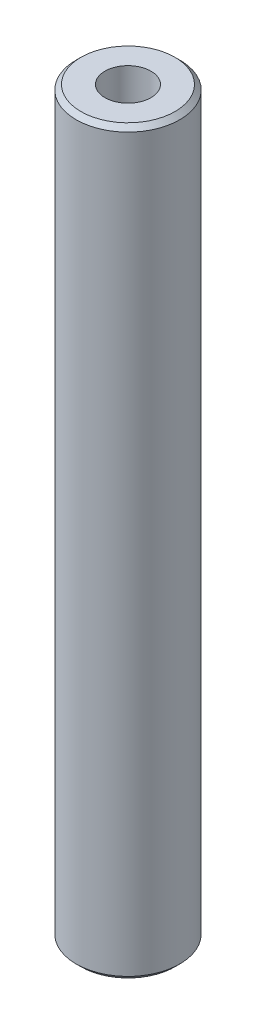
ISO-10303-21;
HEADER;
FILE_DESCRIPTION(('STEP AP214'),'2;1');
FILE_NAME('part.step','',(''),(''),'','','');
FILE_SCHEMA(('AUTOMOTIVE_DESIGN { 1 0 10303 214 1 1 1 1 }'));
ENDSEC;
DATA;
#1=APPLICATION_CONTEXT('core data for automotive mechanical design processes');
#2=APPLICATION_PROTOCOL_DEFINITION('international standard','automotive_design',2000,#1);
#3=PRODUCT_CONTEXT('',#1,'mechanical');
#4=PRODUCT('Part','Part','',(#3));
#5=PRODUCT_RELATED_PRODUCT_CATEGORY('part','',(#4));
#6=PRODUCT_DEFINITION_FORMATION('','',#4);
#7=PRODUCT_DEFINITION_CONTEXT('part definition',#1,'design');
#8=PRODUCT_DEFINITION('design','',#6,#7);
#9=PRODUCT_DEFINITION_SHAPE('','',#8);
#10=(LENGTH_UNIT() NAMED_UNIT(*) SI_UNIT(.MILLI.,.METRE.));
#11=(NAMED_UNIT(*) PLANE_ANGLE_UNIT() SI_UNIT($,.RADIAN.));
#12=(NAMED_UNIT(*) SI_UNIT($,.STERADIAN.) SOLID_ANGLE_UNIT());
#13=UNCERTAINTY_MEASURE_WITH_UNIT(LENGTH_MEASURE(1.E-05),#10,'distance_accuracy_value','');
#14=(GEOMETRIC_REPRESENTATION_CONTEXT(3) GLOBAL_UNCERTAINTY_ASSIGNED_CONTEXT((#13)) GLOBAL_UNIT_ASSIGNED_CONTEXT((#10,
#11,#12)) REPRESENTATION_CONTEXT('',''));
#15=CARTESIAN_POINT('',(0.,0.,0.));
#16=DIRECTION('',(0.,0.,1.));
#17=DIRECTION('',(1.,0.,0.));
#18=AXIS2_PLACEMENT_3D('',#15,#16,#17);
#19=CARTESIAN_POINT('',(0.,107.264778660228,0.));
#20=DIRECTION('',(0.,-1.,0.));
#21=DIRECTION('',(0.,0.,-1.));
#22=AXIS2_PLACEMENT_3D('',#19,#20,#21);
#23=CYLINDRICAL_SURFACE('',#22,7.5);
#24=CARTESIAN_POINT('',(0.,106.577914676238,0.));
#25=DIRECTION('',(0.,1.,0.));
#26=DIRECTION('',(0.,0.,1.));
#27=AXIS2_PLACEMENT_3D('',#24,#25,#26);
#28=CIRCLE('',#27,7.5);
#29=CARTESIAN_POINT('',(0.,106.577914676238,7.5));
#30=VERTEX_POINT('',#29);
#31=EDGE_CURVE('E50',#30,#30,#28,.F.);
#32=ORIENTED_EDGE('',*,*,#31,.T.);
#33=EDGE_LOOP('',(#32));
#34=FACE_BOUND('',#33,.T.);
#35=CARTESIAN_POINT('',(0.,0.6868639839894,0.));
#36=DIRECTION('',(0.,1.,0.));
#37=DIRECTION('',(0.,0.,1.));
#38=AXIS2_PLACEMENT_3D('',#35,#36,#37);
#39=CIRCLE('',#38,7.5);
#40=CARTESIAN_POINT('',(0.,0.6868639839894,7.5));
#41=VERTEX_POINT('',#40);
#42=EDGE_CURVE('E51',#41,#41,#39,.T.);
#43=ORIENTED_EDGE('',*,*,#42,.T.);
#44=EDGE_LOOP('',(#43));
#45=FACE_BOUND('',#44,.T.);
#46=ADVANCED_FACE('F39',(#34,#45),#23,.T.);
#47=CARTESIAN_POINT('',(0.,107.264778660228,0.));
#48=DIRECTION('',(0.,1.,0.));
#49=DIRECTION('',(0.,0.,1.));
#50=AXIS2_PLACEMENT_3D('',#47,#48,#49);
#51=PLANE('',#50);
#52=CARTESIAN_POINT('',(0.,107.264778660228,0.));
#53=DIRECTION('',(0.,1.,0.));
#54=DIRECTION('',(0.,0.,1.));
#55=AXIS2_PLACEMENT_3D('',#52,#53,#54);
#56=CIRCLE('',#55,6.81313601601058);
#57=CARTESIAN_POINT('',(0.,107.264778660228,6.81313601601058));
#58=VERTEX_POINT('',#57);
#59=EDGE_CURVE('E54',#58,#58,#56,.T.);
#60=ORIENTED_EDGE('',*,*,#59,.T.);
#61=EDGE_LOOP('',(#60));
#62=FACE_BOUND('',#61,.T.);
#63=CARTESIAN_POINT('',(0.,107.264778660228,0.));
#64=DIRECTION('',(0.,1.,0.));
#65=DIRECTION('',(0.,0.,1.));
#66=AXIS2_PLACEMENT_3D('',#63,#64,#65);
#67=CIRCLE('',#66,3.3325501859884);
#68=CARTESIAN_POINT('',(0.,107.264778660228,3.3325501859884));
#69=VERTEX_POINT('',#68);
#70=EDGE_CURVE('E58',#69,#69,#67,.T.);
#71=ORIENTED_EDGE('',*,*,#70,.F.);
#72=EDGE_LOOP('',(#71));
#73=FACE_BOUND('',#72,.T.);
#74=ADVANCED_FACE('F69',(#62,#73),#51,.T.);
#75=CARTESIAN_POINT('',(0.,0.,0.));
#76=DIRECTION('',(0.,1.,0.));
#77=DIRECTION('',(0.,0.,1.));
#78=AXIS2_PLACEMENT_3D('',#75,#76,#77);
#79=PLANE('',#78);
#80=CARTESIAN_POINT('',(0.,0.,0.));
#81=DIRECTION('',(0.,1.,0.));
#82=DIRECTION('',(0.,0.,1.));
#83=AXIS2_PLACEMENT_3D('',#80,#81,#82);
#84=CIRCLE('',#83,6.81313601601059);
#85=CARTESIAN_POINT('',(0.,0.,6.81313601601059));
#86=VERTEX_POINT('',#85);
#87=EDGE_CURVE('E10',#86,#86,#84,.F.);
#88=ORIENTED_EDGE('',*,*,#87,.T.);
#89=EDGE_LOOP('',(#88));
#90=FACE_BOUND('',#89,.T.);
#91=CARTESIAN_POINT('',(0.,0.,0.));
#92=DIRECTION('',(0.,1.,0.));
#93=DIRECTION('',(0.,0.,1.));
#94=AXIS2_PLACEMENT_3D('',#91,#92,#93);
#95=CIRCLE('',#94,3.3325501859884);
#96=CARTESIAN_POINT('',(0.,0.,3.3325501859884));
#97=VERTEX_POINT('',#96);
#98=EDGE_CURVE('E63',#97,#97,#95,.T.);
#99=ORIENTED_EDGE('',*,*,#98,.T.);
#100=EDGE_LOOP('',(#99));
#101=FACE_BOUND('',#100,.T.);
#102=ADVANCED_FACE('F75',(#90,#101),#79,.F.);
#103=CARTESIAN_POINT('',(0.,107.264778660228,0.));
#104=DIRECTION('',(0.,-1.,0.));
#105=DIRECTION('',(0.,0.,-1.));
#106=AXIS2_PLACEMENT_3D('',#103,#104,#105);
#107=CYLINDRICAL_SURFACE('',#106,3.3325501859884);
#108=ORIENTED_EDGE('',*,*,#70,.T.);
#109=EDGE_LOOP('',(#108));
#110=FACE_BOUND('',#109,.T.);
#111=ORIENTED_EDGE('',*,*,#98,.F.);
#112=EDGE_LOOP('',(#111));
#113=FACE_BOUND('',#112,.T.);
#114=ADVANCED_FACE('F70',(#110,#113),#107,.F.);
#115=CARTESIAN_POINT('',(0.,107.264778660228,0.));
#116=DIRECTION('',(0.,-1.,0.));
#117=DIRECTION('',(0.,0.,-1.));
#118=AXIS2_PLACEMENT_3D('',#115,#116,#117);
#119=CONICAL_SURFACE('',#118,6.81313601601058,0.785398163397443);
#120=ORIENTED_EDGE('',*,*,#31,.F.);
#121=EDGE_LOOP('',(#120));
#122=FACE_BOUND('',#121,.T.);
#123=ORIENTED_EDGE('',*,*,#59,.F.);
#124=EDGE_LOOP('',(#123));
#125=FACE_BOUND('',#124,.T.);
#126=ADVANCED_FACE('F81',(#122,#125),#119,.T.);
#127=CARTESIAN_POINT('',(0.,0.6868639839894,0.));
#128=DIRECTION('',(0.,1.,0.));
#129=DIRECTION('',(0.,0.,1.));
#130=AXIS2_PLACEMENT_3D('',#127,#128,#129);
#131=CONICAL_SURFACE('',#130,7.5,0.785398163397453);
#132=ORIENTED_EDGE('',*,*,#87,.F.);
#133=EDGE_LOOP('',(#132));
#134=FACE_BOUND('',#133,.T.);
#135=ORIENTED_EDGE('',*,*,#42,.F.);
#136=EDGE_LOOP('',(#135));
#137=FACE_BOUND('',#136,.T.);
#138=ADVANCED_FACE('F45',(#134,#137),#131,.T.);
#139=CLOSED_SHELL('',(#46,#74,#102,#114,#126,#138));
#140=MANIFOLD_SOLID_BREP('B2',#139);
#141=ADVANCED_BREP_SHAPE_REPRESENTATION('',(#18,#140),#14);
#142=SHAPE_DEFINITION_REPRESENTATION(#9,#141);
ENDSEC;
END-ISO-10303-21;
